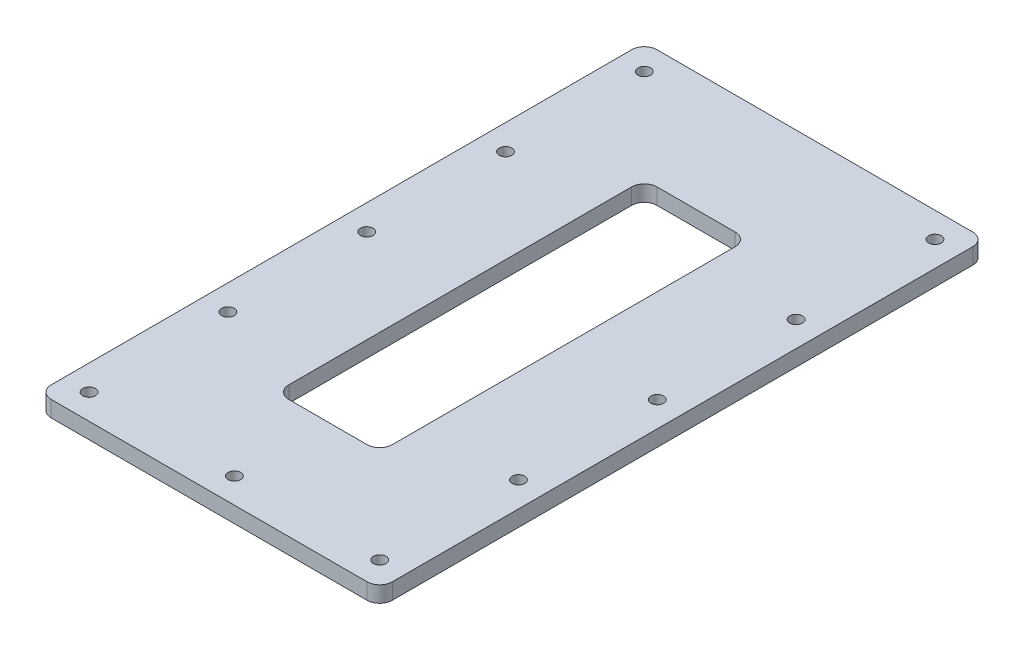
ISO-10303-21;
HEADER;
FILE_DESCRIPTION(('STEP AP214'),'2;1');
FILE_NAME('part.step','',(''),(''),'','','');
FILE_SCHEMA(('AUTOMOTIVE_DESIGN { 1 0 10303 214 1 1 1 1 }'));
ENDSEC;
DATA;
#1=APPLICATION_CONTEXT('core data for automotive mechanical design processes');
#2=APPLICATION_PROTOCOL_DEFINITION('international standard','automotive_design',2000,#1);
#3=PRODUCT_CONTEXT('',#1,'mechanical');
#4=PRODUCT('Part','Part','',(#3));
#5=PRODUCT_RELATED_PRODUCT_CATEGORY('part','',(#4));
#6=PRODUCT_DEFINITION_FORMATION('','',#4);
#7=PRODUCT_DEFINITION_CONTEXT('part definition',#1,'design');
#8=PRODUCT_DEFINITION('design','',#6,#7);
#9=PRODUCT_DEFINITION_SHAPE('','',#8);
#10=(LENGTH_UNIT() NAMED_UNIT(*) SI_UNIT(.MILLI.,.METRE.));
#11=(NAMED_UNIT(*) PLANE_ANGLE_UNIT() SI_UNIT($,.RADIAN.));
#12=(NAMED_UNIT(*) SI_UNIT($,.STERADIAN.) SOLID_ANGLE_UNIT());
#13=UNCERTAINTY_MEASURE_WITH_UNIT(LENGTH_MEASURE(1.E-05),#10,'distance_accuracy_value','');
#14=(GEOMETRIC_REPRESENTATION_CONTEXT(3) GLOBAL_UNCERTAINTY_ASSIGNED_CONTEXT((#13)) GLOBAL_UNIT_ASSIGNED_CONTEXT((#10,
#11,#12)) REPRESENTATION_CONTEXT('',''));
#15=CARTESIAN_POINT('',(0.,0.,0.));
#16=DIRECTION('',(0.,0.,1.));
#17=DIRECTION('',(1.,0.,0.));
#18=AXIS2_PLACEMENT_3D('',#15,#16,#17);
#19=CARTESIAN_POINT('',(67.575,-6.35,-120.));
#20=DIRECTION('',(-1.,0.,0.));
#21=DIRECTION('',(0.,0.,1.));
#22=AXIS2_PLACEMENT_3D('',#19,#20,#21);
#23=PLANE('',#22);
#24=DIRECTION('',(0.,0.,1.));
#25=VECTOR('',#24,1.);
#26=CARTESIAN_POINT('',(67.575,-6.35,-120.));
#27=LINE('',#26,#25);
#28=CARTESIAN_POINT('',(67.575,-6.35,-115.));
#29=VERTEX_POINT('',#28);
#30=CARTESIAN_POINT('',(67.575,-6.35,115.));
#31=VERTEX_POINT('',#30);
#32=EDGE_CURVE('E202',#29,#31,#27,.T.);
#33=ORIENTED_EDGE('',*,*,#32,.F.);
#34=DIRECTION('',(0.,1.,0.));
#35=VECTOR('',#34,1.);
#36=CARTESIAN_POINT('',(67.575,-6.35,-115.));
#37=LINE('',#36,#35);
#38=CARTESIAN_POINT('',(67.575,0.,-115.));
#39=VERTEX_POINT('',#38);
#40=EDGE_CURVE('E256',#29,#39,#37,.T.);
#41=ORIENTED_EDGE('',*,*,#40,.T.);
#42=DIRECTION('',(0.,0.,1.));
#43=VECTOR('',#42,1.);
#44=CARTESIAN_POINT('',(67.575,0.,-120.));
#45=LINE('',#44,#43);
#46=CARTESIAN_POINT('',(67.575,0.,115.));
#47=VERTEX_POINT('',#46);
#48=EDGE_CURVE('E211',#39,#47,#45,.T.);
#49=ORIENTED_EDGE('',*,*,#48,.T.);
#50=DIRECTION('',(0.,1.,0.));
#51=VECTOR('',#50,1.);
#52=CARTESIAN_POINT('',(67.575,-6.35,115.));
#53=LINE('',#52,#51);
#54=EDGE_CURVE('E254',#47,#31,#53,.F.);
#55=ORIENTED_EDGE('',*,*,#54,.T.);
#56=EDGE_LOOP('',(#33,#41,#49,#55));
#57=FACE_BOUND('',#56,.T.);
#58=ADVANCED_FACE('F36',(#57),#23,.F.);
#59=CARTESIAN_POINT('',(-67.575,-6.35,-120.));
#60=DIRECTION('',(1.,0.,0.));
#61=DIRECTION('',(0.,0.,-1.));
#62=AXIS2_PLACEMENT_3D('',#59,#60,#61);
#63=PLANE('',#62);
#64=DIRECTION('',(0.,0.,-1.));
#65=VECTOR('',#64,1.);
#66=CARTESIAN_POINT('',(-67.575,0.,-120.));
#67=LINE('',#66,#65);
#68=CARTESIAN_POINT('',(-67.575,0.,115.));
#69=VERTEX_POINT('',#68);
#70=CARTESIAN_POINT('',(-67.575,0.,-115.));
#71=VERTEX_POINT('',#70);
#72=EDGE_CURVE('E194',#69,#71,#67,.T.);
#73=ORIENTED_EDGE('',*,*,#72,.T.);
#74=DIRECTION('',(0.,1.,0.));
#75=VECTOR('',#74,1.);
#76=CARTESIAN_POINT('',(-67.575,-6.35,-115.));
#77=LINE('',#76,#75);
#78=CARTESIAN_POINT('',(-67.575,-6.35,-115.));
#79=VERTEX_POINT('',#78);
#80=EDGE_CURVE('E245',#71,#79,#77,.F.);
#81=ORIENTED_EDGE('',*,*,#80,.T.);
#82=DIRECTION('',(0.,0.,-1.));
#83=VECTOR('',#82,1.);
#84=CARTESIAN_POINT('',(-67.575,-6.35,-120.));
#85=LINE('',#84,#83);
#86=CARTESIAN_POINT('',(-67.575,-6.35,115.));
#87=VERTEX_POINT('',#86);
#88=EDGE_CURVE('E195',#87,#79,#85,.T.);
#89=ORIENTED_EDGE('',*,*,#88,.F.);
#90=DIRECTION('',(0.,1.,0.));
#91=VECTOR('',#90,1.);
#92=CARTESIAN_POINT('',(-67.575,-6.35,115.));
#93=LINE('',#92,#91);
#94=EDGE_CURVE('E242',#87,#69,#93,.T.);
#95=ORIENTED_EDGE('',*,*,#94,.T.);
#96=EDGE_LOOP('',(#73,#81,#89,#95));
#97=FACE_BOUND('',#96,.T.);
#98=ADVANCED_FACE('F416',(#97),#63,.F.);
#99=CARTESIAN_POINT('',(62.575,-6.35,-115.));
#100=DIRECTION('',(0.,1.,0.));
#101=DIRECTION('',(0.,0.,1.));
#102=AXIS2_PLACEMENT_3D('',#99,#100,#101);
#103=CYLINDRICAL_SURFACE('',#102,5.);
#104=CARTESIAN_POINT('',(62.575,-6.35,-115.));
#105=DIRECTION('',(0.,-1.,0.));
#106=DIRECTION('',(0.,0.,-1.));
#107=AXIS2_PLACEMENT_3D('',#104,#105,#106);
#108=CIRCLE('',#107,5.);
#109=CARTESIAN_POINT('',(62.575,-6.35,-120.));
#110=VERTEX_POINT('',#109);
#111=EDGE_CURVE('E250',#110,#29,#108,.T.);
#112=ORIENTED_EDGE('',*,*,#111,.F.);
#113=DIRECTION('',(0.,1.,0.));
#114=VECTOR('',#113,1.);
#115=CARTESIAN_POINT('',(62.575,-6.35,-120.));
#116=LINE('',#115,#114);
#117=CARTESIAN_POINT('',(62.575,0.,-120.));
#118=VERTEX_POINT('',#117);
#119=EDGE_CURVE('E229',#118,#110,#116,.F.);
#120=ORIENTED_EDGE('',*,*,#119,.F.);
#121=CARTESIAN_POINT('',(62.575,0.,-115.));
#122=DIRECTION('',(0.,-1.,0.));
#123=DIRECTION('',(0.,0.,-1.));
#124=AXIS2_PLACEMENT_3D('',#121,#122,#123);
#125=CIRCLE('',#124,5.);
#126=EDGE_CURVE('E238',#39,#118,#125,.F.);
#127=ORIENTED_EDGE('',*,*,#126,.F.);
#128=ORIENTED_EDGE('',*,*,#40,.F.);
#129=EDGE_LOOP('',(#112,#120,#127,#128));
#130=FACE_BOUND('',#129,.T.);
#131=ADVANCED_FACE('F413',(#130),#103,.T.);
#132=CARTESIAN_POINT('',(-62.575,-6.35,-115.));
#133=DIRECTION('',(0.,1.,0.));
#134=DIRECTION('',(0.,0.,1.));
#135=AXIS2_PLACEMENT_3D('',#132,#133,#134);
#136=CYLINDRICAL_SURFACE('',#135,5.);
#137=CARTESIAN_POINT('',(-62.575,-6.35,-115.));
#138=DIRECTION('',(0.,-1.,0.));
#139=DIRECTION('',(0.,0.,-1.));
#140=AXIS2_PLACEMENT_3D('',#137,#138,#139);
#141=CIRCLE('',#140,5.);
#142=CARTESIAN_POINT('',(-62.575,-6.35,-120.));
#143=VERTEX_POINT('',#142);
#144=EDGE_CURVE('E252',#79,#143,#141,.T.);
#145=ORIENTED_EDGE('',*,*,#144,.F.);
#146=ORIENTED_EDGE('',*,*,#80,.F.);
#147=CARTESIAN_POINT('',(-62.575,0.,-115.));
#148=DIRECTION('',(0.,-1.,0.));
#149=DIRECTION('',(0.,0.,-1.));
#150=AXIS2_PLACEMENT_3D('',#147,#148,#149);
#151=CIRCLE('',#150,5.);
#152=CARTESIAN_POINT('',(-62.575,0.,-120.));
#153=VERTEX_POINT('',#152);
#154=EDGE_CURVE('E240',#153,#71,#151,.F.);
#155=ORIENTED_EDGE('',*,*,#154,.F.);
#156=DIRECTION('',(0.,1.,0.));
#157=VECTOR('',#156,1.);
#158=CARTESIAN_POINT('',(-62.575,-6.35,-120.));
#159=LINE('',#158,#157);
#160=EDGE_CURVE('E231',#143,#153,#159,.T.);
#161=ORIENTED_EDGE('',*,*,#160,.F.);
#162=EDGE_LOOP('',(#145,#146,#155,#161));
#163=FACE_BOUND('',#162,.T.);
#164=ADVANCED_FACE('F410',(#163),#136,.T.);
#165=CARTESIAN_POINT('',(62.575,-6.35,115.));
#166=DIRECTION('',(0.,1.,0.));
#167=DIRECTION('',(0.,0.,1.));
#168=AXIS2_PLACEMENT_3D('',#165,#166,#167);
#169=CYLINDRICAL_SURFACE('',#168,5.);
#170=CARTESIAN_POINT('',(62.575,-6.35,115.));
#171=DIRECTION('',(0.,-1.,0.));
#172=DIRECTION('',(0.,0.,-1.));
#173=AXIS2_PLACEMENT_3D('',#170,#171,#172);
#174=CIRCLE('',#173,5.);
#175=CARTESIAN_POINT('',(62.575,-6.35,120.));
#176=VERTEX_POINT('',#175);
#177=EDGE_CURVE('E60',#31,#176,#174,.T.);
#178=ORIENTED_EDGE('',*,*,#177,.F.);
#179=ORIENTED_EDGE('',*,*,#54,.F.);
#180=CARTESIAN_POINT('',(62.575,0.,115.));
#181=DIRECTION('',(0.,-1.,0.));
#182=DIRECTION('',(0.,0.,-1.));
#183=AXIS2_PLACEMENT_3D('',#180,#181,#182);
#184=CIRCLE('',#183,5.);
#185=CARTESIAN_POINT('',(62.575,0.,120.));
#186=VERTEX_POINT('',#185);
#187=EDGE_CURVE('E234',#186,#47,#184,.F.);
#188=ORIENTED_EDGE('',*,*,#187,.F.);
#189=DIRECTION('',(0.,1.,0.));
#190=VECTOR('',#189,1.);
#191=CARTESIAN_POINT('',(62.575,-6.35,120.));
#192=LINE('',#191,#190);
#193=EDGE_CURVE('E259',#176,#186,#192,.T.);
#194=ORIENTED_EDGE('',*,*,#193,.F.);
#195=EDGE_LOOP('',(#178,#179,#188,#194));
#196=FACE_BOUND('',#195,.T.);
#197=ADVANCED_FACE('F38',(#196),#169,.T.);
#198=CARTESIAN_POINT('',(20.5132278041638,3.65,-72.9382278041638));
#199=DIRECTION('',(1.,0.,0.));
#200=DIRECTION('',(0.,1.,0.));
#201=AXIS2_PLACEMENT_3D('',#198,#199,#200);
#202=PLANE('',#201);
#203=DIRECTION('',(0.,0.,1.));
#204=VECTOR('',#203,1.);
#205=CARTESIAN_POINT('',(20.5132278041638,-6.35,-72.9382278041638));
#206=LINE('',#205,#204);
#207=CARTESIAN_POINT('',(20.5132278041638,-6.35,-67.9382278041638));
#208=VERTEX_POINT('',#207);
#209=CARTESIAN_POINT('',(20.5132278041638,-6.35,67.9382278041638));
#210=VERTEX_POINT('',#209);
#211=EDGE_CURVE('E179',#208,#210,#206,.T.);
#212=ORIENTED_EDGE('',*,*,#211,.T.);
#213=DIRECTION('',(0.,-1.,0.));
#214=VECTOR('',#213,1.);
#215=CARTESIAN_POINT('',(20.5132278041638,0.,67.9382278041638));
#216=LINE('',#215,#214);
#217=CARTESIAN_POINT('',(20.5132278041638,0.,67.9382278041638));
#218=VERTEX_POINT('',#217);
#219=EDGE_CURVE('E157',#210,#218,#216,.F.);
#220=ORIENTED_EDGE('',*,*,#219,.T.);
#221=DIRECTION('',(0.,0.,1.));
#222=VECTOR('',#221,1.);
#223=CARTESIAN_POINT('',(20.5132278041638,0.,0.));
#224=LINE('',#223,#222);
#225=CARTESIAN_POINT('',(20.5132278041638,0.,-67.9382278041638));
#226=VERTEX_POINT('',#225);
#227=EDGE_CURVE('E182',#226,#218,#224,.T.);
#228=ORIENTED_EDGE('',*,*,#227,.F.);
#229=DIRECTION('',(0.,-1.,0.));
#230=VECTOR('',#229,1.);
#231=CARTESIAN_POINT('',(20.5132278041638,-6.35,-67.9382278041638));
#232=LINE('',#231,#230);
#233=EDGE_CURVE('E172',#226,#208,#232,.T.);
#234=ORIENTED_EDGE('',*,*,#233,.T.);
#235=EDGE_LOOP('',(#212,#220,#228,#234));
#236=FACE_BOUND('',#235,.T.);
#237=ADVANCED_FACE('F376',(#236),#202,.F.);
#238=CARTESIAN_POINT('',(0.,-6.35,0.));
#239=DIRECTION('',(0.,-1.,0.));
#240=DIRECTION('',(0.,0.,-1.));
#241=AXIS2_PLACEMENT_3D('',#238,#239,#240);
#242=PLANE('',#241);
#243=CARTESIAN_POINT('',(57.5749999999999,-6.35,-110.));
#244=DIRECTION('',(0.,-1.,0.));
#245=DIRECTION('',(0.,0.,-1.));
#246=AXIS2_PLACEMENT_3D('',#243,#244,#245);
#247=CIRCLE('',#246,2.5);
#248=CARTESIAN_POINT('',(57.5749999999999,-6.35,-112.5));
#249=VERTEX_POINT('',#248);
#250=EDGE_CURVE('E40',#249,#249,#247,.T.);
#251=ORIENTED_EDGE('',*,*,#250,.F.);
#252=EDGE_LOOP('',(#251));
#253=FACE_BOUND('',#252,.T.);
#254=CARTESIAN_POINT('',(-57.5750000000001,-6.35,-110.));
#255=DIRECTION('',(0.,-1.,0.));
#256=DIRECTION('',(0.,0.,-1.));
#257=AXIS2_PLACEMENT_3D('',#254,#255,#256);
#258=CIRCLE('',#257,2.50000000000001);
#259=CARTESIAN_POINT('',(-57.5750000000001,-6.35,-112.5));
#260=VERTEX_POINT('',#259);
#261=EDGE_CURVE('E299',#260,#260,#258,.T.);
#262=ORIENTED_EDGE('',*,*,#261,.F.);
#263=EDGE_LOOP('',(#262));
#264=FACE_BOUND('',#263,.T.);
#265=CARTESIAN_POINT('',(-57.5750000000001,-6.35,-55.));
#266=DIRECTION('',(0.,-1.,0.));
#267=DIRECTION('',(0.,0.,-1.));
#268=AXIS2_PLACEMENT_3D('',#265,#266,#267);
#269=CIRCLE('',#268,2.5);
#270=CARTESIAN_POINT('',(-57.5750000000001,-6.35,-57.5));
#271=VERTEX_POINT('',#270);
#272=EDGE_CURVE('E297',#271,#271,#269,.T.);
#273=ORIENTED_EDGE('',*,*,#272,.F.);
#274=EDGE_LOOP('',(#273));
#275=FACE_BOUND('',#274,.T.);
#276=CARTESIAN_POINT('',(57.5749999999999,-6.35,-55.));
#277=DIRECTION('',(0.,-1.,0.));
#278=DIRECTION('',(0.,0.,-1.));
#279=AXIS2_PLACEMENT_3D('',#276,#277,#278);
#280=CIRCLE('',#279,2.5);
#281=CARTESIAN_POINT('',(57.5749999999999,-6.35,-57.5));
#282=VERTEX_POINT('',#281);
#283=EDGE_CURVE('E294',#282,#282,#280,.T.);
#284=ORIENTED_EDGE('',*,*,#283,.F.);
#285=EDGE_LOOP('',(#284));
#286=FACE_BOUND('',#285,.T.);
#287=CARTESIAN_POINT('',(57.5749999999999,-6.35,0.));
#288=DIRECTION('',(0.,-1.,0.));
#289=DIRECTION('',(0.,0.,-1.));
#290=AXIS2_PLACEMENT_3D('',#287,#288,#289);
#291=CIRCLE('',#290,2.5);
#292=CARTESIAN_POINT('',(57.5749999999999,-6.35,-2.49999999999996));
#293=VERTEX_POINT('',#292);
#294=EDGE_CURVE('E291',#293,#293,#291,.T.);
#295=ORIENTED_EDGE('',*,*,#294,.F.);
#296=EDGE_LOOP('',(#295));
#297=FACE_BOUND('',#296,.T.);
#298=CARTESIAN_POINT('',(-57.5750000000001,-6.35,0.));
#299=DIRECTION('',(0.,-1.,0.));
#300=DIRECTION('',(0.,0.,-1.));
#301=AXIS2_PLACEMENT_3D('',#298,#299,#300);
#302=CIRCLE('',#301,2.5);
#303=CARTESIAN_POINT('',(-57.5750000000001,-6.35,-2.49999999999996));
#304=VERTEX_POINT('',#303);
#305=EDGE_CURVE('E288',#304,#304,#302,.T.);
#306=ORIENTED_EDGE('',*,*,#305,.F.);
#307=EDGE_LOOP('',(#306));
#308=FACE_BOUND('',#307,.T.);
#309=CARTESIAN_POINT('',(-57.5750000000001,-6.35,55.));
#310=DIRECTION('',(0.,-1.,0.));
#311=DIRECTION('',(0.,0.,-1.));
#312=AXIS2_PLACEMENT_3D('',#309,#310,#311);
#313=CIRCLE('',#312,2.5);
#314=CARTESIAN_POINT('',(-57.5750000000001,-6.35,52.5));
#315=VERTEX_POINT('',#314);
#316=EDGE_CURVE('E285',#315,#315,#313,.T.);
#317=ORIENTED_EDGE('',*,*,#316,.F.);
#318=EDGE_LOOP('',(#317));
#319=FACE_BOUND('',#318,.T.);
#320=CARTESIAN_POINT('',(57.5749999999999,-6.35,55.));
#321=DIRECTION('',(0.,-1.,0.));
#322=DIRECTION('',(0.,0.,-1.));
#323=AXIS2_PLACEMENT_3D('',#320,#321,#322);
#324=CIRCLE('',#323,2.5);
#325=CARTESIAN_POINT('',(57.5749999999999,-6.35,52.5));
#326=VERTEX_POINT('',#325);
#327=EDGE_CURVE('E282',#326,#326,#324,.T.);
#328=ORIENTED_EDGE('',*,*,#327,.F.);
#329=EDGE_LOOP('',(#328));
#330=FACE_BOUND('',#329,.T.);
#331=CARTESIAN_POINT('',(57.5749999999999,-6.35,110.));
#332=DIRECTION('',(0.,-1.,0.));
#333=DIRECTION('',(0.,0.,-1.));
#334=AXIS2_PLACEMENT_3D('',#331,#332,#333);
#335=CIRCLE('',#334,2.50000000000001);
#336=CARTESIAN_POINT('',(57.5749999999999,-6.35,107.5));
#337=VERTEX_POINT('',#336);
#338=EDGE_CURVE('E279',#337,#337,#335,.T.);
#339=ORIENTED_EDGE('',*,*,#338,.F.);
#340=EDGE_LOOP('',(#339));
#341=FACE_BOUND('',#340,.T.);
#342=CARTESIAN_POINT('',(-1.11022302462516E-13,-6.35,110.));
#343=DIRECTION('',(0.,-1.,0.));
#344=DIRECTION('',(0.,0.,-1.));
#345=AXIS2_PLACEMENT_3D('',#342,#343,#344);
#346=CIRCLE('',#345,2.5);
#347=CARTESIAN_POINT('',(-1.11022302462516E-13,-6.35,107.5));
#348=VERTEX_POINT('',#347);
#349=EDGE_CURVE('E275',#348,#348,#346,.T.);
#350=ORIENTED_EDGE('',*,*,#349,.F.);
#351=EDGE_LOOP('',(#350));
#352=FACE_BOUND('',#351,.T.);
#353=CARTESIAN_POINT('',(-57.5750000000001,-6.35,110.));
#354=DIRECTION('',(0.,-1.,0.));
#355=DIRECTION('',(0.,0.,-1.));
#356=AXIS2_PLACEMENT_3D('',#353,#354,#355);
#357=CIRCLE('',#356,2.5);
#358=CARTESIAN_POINT('',(-57.5750000000001,-6.35,107.5));
#359=VERTEX_POINT('',#358);
#360=EDGE_CURVE('E272',#359,#359,#357,.T.);
#361=ORIENTED_EDGE('',*,*,#360,.F.);
#362=EDGE_LOOP('',(#361));
#363=FACE_BOUND('',#362,.T.);
#364=DIRECTION('',(0.,0.,-1.));
#365=VECTOR('',#364,1.);
#366=CARTESIAN_POINT('',(-20.5132278041638,-6.35,-72.9382278041638));
#367=LINE('',#366,#365);
#368=CARTESIAN_POINT('',(-20.5132278041638,-6.35,67.9382278041638));
#369=VERTEX_POINT('',#368);
#370=CARTESIAN_POINT('',(-20.5132278041638,-6.35,-67.9382278041638));
#371=VERTEX_POINT('',#370);
#372=EDGE_CURVE('E304',#369,#371,#367,.T.);
#373=ORIENTED_EDGE('',*,*,#372,.F.);
#374=CARTESIAN_POINT('',(-15.5132278041638,-6.35,67.9382278041638));
#375=DIRECTION('',(0.,-1.,0.));
#376=DIRECTION('',(0.,0.,-1.));
#377=AXIS2_PLACEMENT_3D('',#374,#375,#376);
#378=CIRCLE('',#377,5.);
#379=CARTESIAN_POINT('',(-15.5132278041638,-6.35,72.9382278041638));
#380=VERTEX_POINT('',#379);
#381=EDGE_CURVE('E177',#369,#380,#378,.F.);
#382=ORIENTED_EDGE('',*,*,#381,.T.);
#383=DIRECTION('',(-1.,0.,0.));
#384=VECTOR('',#383,1.);
#385=CARTESIAN_POINT('',(20.5132278041638,-6.35,72.9382278041638));
#386=LINE('',#385,#384);
#387=CARTESIAN_POINT('',(15.5132278041638,-6.35,72.9382278041638));
#388=VERTEX_POINT('',#387);
#389=EDGE_CURVE('E168',#388,#380,#386,.T.);
#390=ORIENTED_EDGE('',*,*,#389,.F.);
#391=CARTESIAN_POINT('',(15.5132278041638,-6.35,67.9382278041638));
#392=DIRECTION('',(0.,-1.,0.));
#393=DIRECTION('',(0.,0.,-1.));
#394=AXIS2_PLACEMENT_3D('',#391,#392,#393);
#395=CIRCLE('',#394,5.);
#396=EDGE_CURVE('E152',#388,#210,#395,.F.);
#397=ORIENTED_EDGE('',*,*,#396,.T.);
#398=ORIENTED_EDGE('',*,*,#211,.F.);
#399=CARTESIAN_POINT('',(15.5132278041638,-6.35,-67.9382278041638));
#400=DIRECTION('',(0.,-1.,0.));
#401=DIRECTION('',(0.,0.,-1.));
#402=AXIS2_PLACEMENT_3D('',#399,#400,#401);
#403=CIRCLE('',#402,5.);
#404=CARTESIAN_POINT('',(15.5132278041638,-6.35,-72.9382278041638));
#405=VERTEX_POINT('',#404);
#406=EDGE_CURVE('E45',#208,#405,#403,.F.);
#407=ORIENTED_EDGE('',*,*,#406,.T.);
#408=DIRECTION('',(1.,0.,0.));
#409=VECTOR('',#408,1.);
#410=CARTESIAN_POINT('',(20.5132278041638,-6.35,-72.9382278041638));
#411=LINE('',#410,#409);
#412=CARTESIAN_POINT('',(-15.5132278041638,-6.35,-72.9382278041638));
#413=VERTEX_POINT('',#412);
#414=EDGE_CURVE('E184',#413,#405,#411,.T.);
#415=ORIENTED_EDGE('',*,*,#414,.F.);
#416=CARTESIAN_POINT('',(-15.5132278041638,-6.35,-67.9382278041638));
#417=DIRECTION('',(0.,-1.,0.));
#418=DIRECTION('',(0.,0.,-1.));
#419=AXIS2_PLACEMENT_3D('',#416,#417,#418);
#420=CIRCLE('',#419,5.);
#421=EDGE_CURVE('E267',#413,#371,#420,.F.);
#422=ORIENTED_EDGE('',*,*,#421,.T.);
#423=EDGE_LOOP('',(#373,#382,#390,#397,#398,#407,#415,#422));
#424=FACE_BOUND('',#423,.T.);
#425=ORIENTED_EDGE('',*,*,#88,.T.);
#426=ORIENTED_EDGE('',*,*,#144,.T.);
#427=DIRECTION('',(1.,0.,0.));
#428=VECTOR('',#427,1.);
#429=CARTESIAN_POINT('',(67.575,-6.35,-120.));
#430=LINE('',#429,#428);
#431=EDGE_CURVE('E198',#143,#110,#430,.T.);
#432=ORIENTED_EDGE('',*,*,#431,.T.);
#433=ORIENTED_EDGE('',*,*,#111,.T.);
#434=ORIENTED_EDGE('',*,*,#32,.T.);
#435=ORIENTED_EDGE('',*,*,#177,.T.);
#436=DIRECTION('',(-1.,0.,0.));
#437=VECTOR('',#436,1.);
#438=CARTESIAN_POINT('',(67.575,-6.35,120.));
#439=LINE('',#438,#437);
#440=CARTESIAN_POINT('',(-62.575,-6.35,120.));
#441=VERTEX_POINT('',#440);
#442=EDGE_CURVE('E204',#176,#441,#439,.T.);
#443=ORIENTED_EDGE('',*,*,#442,.T.);
#444=CARTESIAN_POINT('',(-62.575,-6.35,115.));
#445=DIRECTION('',(0.,-1.,0.));
#446=DIRECTION('',(0.,0.,-1.));
#447=AXIS2_PLACEMENT_3D('',#444,#445,#446);
#448=CIRCLE('',#447,5.);
#449=EDGE_CURVE('E248',#441,#87,#448,.T.);
#450=ORIENTED_EDGE('',*,*,#449,.T.);
#451=EDGE_LOOP('',(#425,#426,#432,#433,#434,#435,#443,#450));
#452=FACE_BOUND('',#451,.T.);
#453=ADVANCED_FACE('F176',(#253,#264,#275,#286,#297,#308,#319,#330,#341,#352,#363,#424,#452),
#242,.T.);
#454=CARTESIAN_POINT('',(57.5749999999999,-10.,-110.));
#455=DIRECTION('',(0.,1.,0.));
#456=DIRECTION('',(0.,0.,1.));
#457=AXIS2_PLACEMENT_3D('',#454,#455,#456);
#458=CYLINDRICAL_SURFACE('',#457,2.5);
#459=ORIENTED_EDGE('',*,*,#250,.T.);
#460=EDGE_LOOP('',(#459));
#461=FACE_BOUND('',#460,.T.);
#462=CARTESIAN_POINT('',(57.5749999999999,0.,-110.));
#463=DIRECTION('',(0.,1.,0.));
#464=DIRECTION('',(0.,0.,1.));
#465=AXIS2_PLACEMENT_3D('',#462,#463,#464);
#466=CIRCLE('',#465,2.5);
#467=CARTESIAN_POINT('',(57.5749999999999,0.,-107.5));
#468=VERTEX_POINT('',#467);
#469=EDGE_CURVE('E316',#468,#468,#466,.T.);
#470=ORIENTED_EDGE('',*,*,#469,.T.);
#471=EDGE_LOOP('',(#470));
#472=FACE_BOUND('',#471,.T.);
#473=ADVANCED_FACE('F464',(#461,#472),#458,.F.);
#474=CARTESIAN_POINT('',(-57.5750000000001,-10.,-110.));
#475=DIRECTION('',(0.,1.,0.));
#476=DIRECTION('',(0.,0.,1.));
#477=AXIS2_PLACEMENT_3D('',#474,#475,#476);
#478=CYLINDRICAL_SURFACE('',#477,2.50000000000001);
#479=ORIENTED_EDGE('',*,*,#261,.T.);
#480=EDGE_LOOP('',(#479));
#481=FACE_BOUND('',#480,.T.);
#482=CARTESIAN_POINT('',(-57.5750000000001,0.,-110.));
#483=DIRECTION('',(0.,1.,0.));
#484=DIRECTION('',(0.,0.,1.));
#485=AXIS2_PLACEMENT_3D('',#482,#483,#484);
#486=CIRCLE('',#485,2.50000000000001);
#487=CARTESIAN_POINT('',(-57.5750000000001,0.,-107.5));
#488=VERTEX_POINT('',#487);
#489=EDGE_CURVE('E319',#488,#488,#486,.T.);
#490=ORIENTED_EDGE('',*,*,#489,.T.);
#491=EDGE_LOOP('',(#490));
#492=FACE_BOUND('',#491,.T.);
#493=ADVANCED_FACE('F521',(#481,#492),#478,.F.);
#494=CARTESIAN_POINT('',(-57.5750000000001,-10.,-55.));
#495=DIRECTION('',(0.,1.,0.));
#496=DIRECTION('',(0.,0.,1.));
#497=AXIS2_PLACEMENT_3D('',#494,#495,#496);
#498=CYLINDRICAL_SURFACE('',#497,2.5);
#499=ORIENTED_EDGE('',*,*,#272,.T.);
#500=EDGE_LOOP('',(#499));
#501=FACE_BOUND('',#500,.T.);
#502=CARTESIAN_POINT('',(-57.5750000000001,0.,-55.));
#503=DIRECTION('',(0.,1.,0.));
#504=DIRECTION('',(0.,0.,1.));
#505=AXIS2_PLACEMENT_3D('',#502,#503,#504);
#506=CIRCLE('',#505,2.5);
#507=CARTESIAN_POINT('',(-57.5750000000001,0.,-52.5));
#508=VERTEX_POINT('',#507);
#509=EDGE_CURVE('E322',#508,#508,#506,.T.);
#510=ORIENTED_EDGE('',*,*,#509,.T.);
#511=EDGE_LOOP('',(#510));
#512=FACE_BOUND('',#511,.T.);
#513=ADVANCED_FACE('F528',(#501,#512),#498,.F.);
#514=CARTESIAN_POINT('',(57.5749999999999,-10.,-55.));
#515=DIRECTION('',(0.,1.,0.));
#516=DIRECTION('',(0.,0.,1.));
#517=AXIS2_PLACEMENT_3D('',#514,#515,#516);
#518=CYLINDRICAL_SURFACE('',#517,2.5);
#519=ORIENTED_EDGE('',*,*,#283,.T.);
#520=EDGE_LOOP('',(#519));
#521=FACE_BOUND('',#520,.T.);
#522=CARTESIAN_POINT('',(57.5749999999999,0.,-55.));
#523=DIRECTION('',(0.,1.,0.));
#524=DIRECTION('',(0.,0.,1.));
#525=AXIS2_PLACEMENT_3D('',#522,#523,#524);
#526=CIRCLE('',#525,2.5);
#527=CARTESIAN_POINT('',(57.5749999999999,0.,-52.5));
#528=VERTEX_POINT('',#527);
#529=EDGE_CURVE('E325',#528,#528,#526,.T.);
#530=ORIENTED_EDGE('',*,*,#529,.T.);
#531=EDGE_LOOP('',(#530));
#532=FACE_BOUND('',#531,.T.);
#533=ADVANCED_FACE('F535',(#521,#532),#518,.F.);
#534=CARTESIAN_POINT('',(57.5749999999999,-10.,0.));
#535=DIRECTION('',(0.,1.,0.));
#536=DIRECTION('',(0.,0.,1.));
#537=AXIS2_PLACEMENT_3D('',#534,#535,#536);
#538=CYLINDRICAL_SURFACE('',#537,2.5);
#539=ORIENTED_EDGE('',*,*,#294,.T.);
#540=EDGE_LOOP('',(#539));
#541=FACE_BOUND('',#540,.T.);
#542=CARTESIAN_POINT('',(57.5749999999999,0.,0.));
#543=DIRECTION('',(0.,1.,0.));
#544=DIRECTION('',(0.,0.,1.));
#545=AXIS2_PLACEMENT_3D('',#542,#543,#544);
#546=CIRCLE('',#545,2.5);
#547=CARTESIAN_POINT('',(57.5749999999999,0.,2.50000000000004));
#548=VERTEX_POINT('',#547);
#549=EDGE_CURVE('E328',#548,#548,#546,.T.);
#550=ORIENTED_EDGE('',*,*,#549,.T.);
#551=EDGE_LOOP('',(#550));
#552=FACE_BOUND('',#551,.T.);
#553=ADVANCED_FACE('F544',(#541,#552),#538,.F.);
#554=CARTESIAN_POINT('',(-57.5750000000001,-10.,0.));
#555=DIRECTION('',(0.,1.,0.));
#556=DIRECTION('',(0.,0.,1.));
#557=AXIS2_PLACEMENT_3D('',#554,#555,#556);
#558=CYLINDRICAL_SURFACE('',#557,2.5);
#559=ORIENTED_EDGE('',*,*,#305,.T.);
#560=EDGE_LOOP('',(#559));
#561=FACE_BOUND('',#560,.T.);
#562=CARTESIAN_POINT('',(-57.5750000000001,0.,0.));
#563=DIRECTION('',(0.,1.,0.));
#564=DIRECTION('',(0.,0.,1.));
#565=AXIS2_PLACEMENT_3D('',#562,#563,#564);
#566=CIRCLE('',#565,2.5);
#567=CARTESIAN_POINT('',(-57.5750000000001,0.,2.50000000000005));
#568=VERTEX_POINT('',#567);
#569=EDGE_CURVE('E331',#568,#568,#566,.T.);
#570=ORIENTED_EDGE('',*,*,#569,.T.);
#571=EDGE_LOOP('',(#570));
#572=FACE_BOUND('',#571,.T.);
#573=ADVANCED_FACE('F553',(#561,#572),#558,.F.);
#574=CARTESIAN_POINT('',(-57.5750000000001,-10.,55.));
#575=DIRECTION('',(0.,1.,0.));
#576=DIRECTION('',(0.,0.,1.));
#577=AXIS2_PLACEMENT_3D('',#574,#575,#576);
#578=CYLINDRICAL_SURFACE('',#577,2.5);
#579=ORIENTED_EDGE('',*,*,#316,.T.);
#580=EDGE_LOOP('',(#579));
#581=FACE_BOUND('',#580,.T.);
#582=CARTESIAN_POINT('',(-57.5750000000001,0.,55.));
#583=DIRECTION('',(0.,1.,0.));
#584=DIRECTION('',(0.,0.,1.));
#585=AXIS2_PLACEMENT_3D('',#582,#583,#584);
#586=CIRCLE('',#585,2.5);
#587=CARTESIAN_POINT('',(-57.5750000000001,0.,57.5));
#588=VERTEX_POINT('',#587);
#589=EDGE_CURVE('E334',#588,#588,#586,.T.);
#590=ORIENTED_EDGE('',*,*,#589,.T.);
#591=EDGE_LOOP('',(#590));
#592=FACE_BOUND('',#591,.T.);
#593=ADVANCED_FACE('F562',(#581,#592),#578,.F.);
#594=CARTESIAN_POINT('',(57.5749999999999,-10.,55.));
#595=DIRECTION('',(0.,1.,0.));
#596=DIRECTION('',(0.,0.,1.));
#597=AXIS2_PLACEMENT_3D('',#594,#595,#596);
#598=CYLINDRICAL_SURFACE('',#597,2.5);
#599=ORIENTED_EDGE('',*,*,#327,.T.);
#600=EDGE_LOOP('',(#599));
#601=FACE_BOUND('',#600,.T.);
#602=CARTESIAN_POINT('',(57.5749999999999,0.,55.));
#603=DIRECTION('',(0.,1.,0.));
#604=DIRECTION('',(0.,0.,1.));
#605=AXIS2_PLACEMENT_3D('',#602,#603,#604);
#606=CIRCLE('',#605,2.5);
#607=CARTESIAN_POINT('',(57.5749999999999,0.,57.5));
#608=VERTEX_POINT('',#607);
#609=EDGE_CURVE('E337',#608,#608,#606,.T.);
#610=ORIENTED_EDGE('',*,*,#609,.T.);
#611=EDGE_LOOP('',(#610));
#612=FACE_BOUND('',#611,.T.);
#613=ADVANCED_FACE('F571',(#601,#612),#598,.F.);
#614=CARTESIAN_POINT('',(57.5749999999999,-10.,110.));
#615=DIRECTION('',(0.,1.,0.));
#616=DIRECTION('',(0.,0.,1.));
#617=AXIS2_PLACEMENT_3D('',#614,#615,#616);
#618=CYLINDRICAL_SURFACE('',#617,2.50000000000001);
#619=ORIENTED_EDGE('',*,*,#338,.T.);
#620=EDGE_LOOP('',(#619));
#621=FACE_BOUND('',#620,.T.);
#622=CARTESIAN_POINT('',(57.5749999999999,0.,110.));
#623=DIRECTION('',(0.,1.,0.));
#624=DIRECTION('',(0.,0.,1.));
#625=AXIS2_PLACEMENT_3D('',#622,#623,#624);
#626=CIRCLE('',#625,2.50000000000001);
#627=CARTESIAN_POINT('',(57.5749999999999,0.,112.5));
#628=VERTEX_POINT('',#627);
#629=EDGE_CURVE('E340',#628,#628,#626,.T.);
#630=ORIENTED_EDGE('',*,*,#629,.T.);
#631=EDGE_LOOP('',(#630));
#632=FACE_BOUND('',#631,.T.);
#633=ADVANCED_FACE('F460',(#621,#632),#618,.F.);
#634=CARTESIAN_POINT('',(-1.11022302462516E-13,-10.,110.));
#635=DIRECTION('',(0.,1.,0.));
#636=DIRECTION('',(0.,0.,1.));
#637=AXIS2_PLACEMENT_3D('',#634,#635,#636);
#638=CYLINDRICAL_SURFACE('',#637,2.5);
#639=ORIENTED_EDGE('',*,*,#349,.T.);
#640=EDGE_LOOP('',(#639));
#641=FACE_BOUND('',#640,.T.);
#642=CARTESIAN_POINT('',(-1.11022302462516E-13,0.,110.));
#643=DIRECTION('',(0.,1.,0.));
#644=DIRECTION('',(0.,0.,1.));
#645=AXIS2_PLACEMENT_3D('',#642,#643,#644);
#646=CIRCLE('',#645,2.5);
#647=CARTESIAN_POINT('',(-1.11022302462516E-13,0.,112.5));
#648=VERTEX_POINT('',#647);
#649=EDGE_CURVE('E315',#648,#648,#646,.T.);
#650=ORIENTED_EDGE('',*,*,#649,.T.);
#651=EDGE_LOOP('',(#650));
#652=FACE_BOUND('',#651,.T.);
#653=ADVANCED_FACE('F346',(#641,#652),#638,.F.);
#654=CARTESIAN_POINT('',(-57.5750000000001,-10.,110.));
#655=DIRECTION('',(0.,1.,0.));
#656=DIRECTION('',(0.,0.,1.));
#657=AXIS2_PLACEMENT_3D('',#654,#655,#656);
#658=CYLINDRICAL_SURFACE('',#657,2.5);
#659=ORIENTED_EDGE('',*,*,#360,.T.);
#660=EDGE_LOOP('',(#659));
#661=FACE_BOUND('',#660,.T.);
#662=CARTESIAN_POINT('',(-57.5750000000001,0.,110.));
#663=DIRECTION('',(0.,1.,0.));
#664=DIRECTION('',(0.,0.,1.));
#665=AXIS2_PLACEMENT_3D('',#662,#663,#664);
#666=CIRCLE('',#665,2.5);
#667=CARTESIAN_POINT('',(-57.5750000000001,0.,112.5));
#668=VERTEX_POINT('',#667);
#669=EDGE_CURVE('E276',#668,#668,#666,.T.);
#670=ORIENTED_EDGE('',*,*,#669,.T.);
#671=EDGE_LOOP('',(#670));
#672=FACE_BOUND('',#671,.T.);
#673=ADVANCED_FACE('F450',(#661,#672),#658,.F.);
#674=CARTESIAN_POINT('',(20.5132278041638,3.65,-72.9382278041638));
#675=DIRECTION('',(0.,0.,-1.));
#676=DIRECTION('',(0.,1.,0.));
#677=AXIS2_PLACEMENT_3D('',#674,#675,#676);
#678=PLANE('',#677);
#679=DIRECTION('',(1.,0.,0.));
#680=VECTOR('',#679,1.);
#681=CARTESIAN_POINT('',(0.,0.,-72.9382278041638));
#682=LINE('',#681,#680);
#683=CARTESIAN_POINT('',(-15.5132278041638,0.,-72.9382278041638));
#684=VERTEX_POINT('',#683);
#685=CARTESIAN_POINT('',(15.5132278041638,0.,-72.9382278041638));
#686=VERTEX_POINT('',#685);
#687=EDGE_CURVE('E178',#684,#686,#682,.T.);
#688=ORIENTED_EDGE('',*,*,#687,.F.);
#689=DIRECTION('',(0.,-1.,0.));
#690=VECTOR('',#689,1.);
#691=CARTESIAN_POINT('',(-15.5132278041638,-6.35,-72.9382278041638));
#692=LINE('',#691,#690);
#693=EDGE_CURVE('E226',#684,#413,#692,.T.);
#694=ORIENTED_EDGE('',*,*,#693,.T.);
#695=ORIENTED_EDGE('',*,*,#414,.T.);
#696=DIRECTION('',(0.,-1.,0.));
#697=VECTOR('',#696,1.);
#698=CARTESIAN_POINT('',(15.5132278041638,0.,-72.9382278041638));
#699=LINE('',#698,#697);
#700=EDGE_CURVE('E224',#405,#686,#699,.F.);
#701=ORIENTED_EDGE('',*,*,#700,.T.);
#702=EDGE_LOOP('',(#688,#694,#695,#701));
#703=FACE_BOUND('',#702,.T.);
#704=ADVANCED_FACE('F383',(#703),#678,.F.);
#705=CARTESIAN_POINT('',(15.5132278041638,3.65,-67.9382278041638));
#706=DIRECTION('',(0.,1.,0.));
#707=DIRECTION('',(0.,0.,1.));
#708=AXIS2_PLACEMENT_3D('',#705,#706,#707);
#709=CYLINDRICAL_SURFACE('',#708,5.);
#710=CARTESIAN_POINT('',(15.5132278041638,0.,-67.9382278041638));
#711=DIRECTION('',(0.,-1.,0.));
#712=DIRECTION('',(0.,0.,-1.));
#713=AXIS2_PLACEMENT_3D('',#710,#711,#712);
#714=CIRCLE('',#713,5.);
#715=EDGE_CURVE('E11',#686,#226,#714,.T.);
#716=ORIENTED_EDGE('',*,*,#715,.F.);
#717=ORIENTED_EDGE('',*,*,#700,.F.);
#718=ORIENTED_EDGE('',*,*,#406,.F.);
#719=ORIENTED_EDGE('',*,*,#233,.F.);
#720=EDGE_LOOP('',(#716,#717,#718,#719));
#721=FACE_BOUND('',#720,.T.);
#722=ADVANCED_FACE('F378',(#721),#709,.F.);
#723=CARTESIAN_POINT('',(-20.5132278041638,3.65,-72.9382278041638));
#724=DIRECTION('',(-1.,0.,0.));
#725=DIRECTION('',(0.,-1.,0.));
#726=AXIS2_PLACEMENT_3D('',#723,#724,#725);
#727=PLANE('',#726);
#728=DIRECTION('',(0.,0.,-1.));
#729=VECTOR('',#728,1.);
#730=CARTESIAN_POINT('',(-20.5132278041638,0.,0.));
#731=LINE('',#730,#729);
#732=CARTESIAN_POINT('',(-20.5132278041638,0.,67.9382278041638));
#733=VERTEX_POINT('',#732);
#734=CARTESIAN_POINT('',(-20.5132278041638,0.,-67.9382278041638));
#735=VERTEX_POINT('',#734);
#736=EDGE_CURVE('E191',#733,#735,#731,.T.);
#737=ORIENTED_EDGE('',*,*,#736,.F.);
#738=DIRECTION('',(0.,-1.,0.));
#739=VECTOR('',#738,1.);
#740=CARTESIAN_POINT('',(-20.5132278041638,-6.35,67.9382278041638));
#741=LINE('',#740,#739);
#742=EDGE_CURVE('E221',#733,#369,#741,.T.);
#743=ORIENTED_EDGE('',*,*,#742,.T.);
#744=ORIENTED_EDGE('',*,*,#372,.T.);
#745=DIRECTION('',(0.,-1.,0.));
#746=VECTOR('',#745,1.);
#747=CARTESIAN_POINT('',(-20.5132278041638,0.,-67.9382278041638));
#748=LINE('',#747,#746);
#749=EDGE_CURVE('E219',#371,#735,#748,.F.);
#750=ORIENTED_EDGE('',*,*,#749,.T.);
#751=EDGE_LOOP('',(#737,#743,#744,#750));
#752=FACE_BOUND('',#751,.T.);
#753=ADVANCED_FACE('F389',(#752),#727,.F.);
#754=CARTESIAN_POINT('',(-15.5132278041638,3.65,-67.9382278041638));
#755=DIRECTION('',(0.,1.,0.));
#756=DIRECTION('',(0.,0.,1.));
#757=AXIS2_PLACEMENT_3D('',#754,#755,#756);
#758=CYLINDRICAL_SURFACE('',#757,5.);
#759=CARTESIAN_POINT('',(-15.5132278041638,0.,-67.9382278041638));
#760=DIRECTION('',(0.,-1.,0.));
#761=DIRECTION('',(0.,0.,-1.));
#762=AXIS2_PLACEMENT_3D('',#759,#760,#761);
#763=CIRCLE('',#762,5.);
#764=EDGE_CURVE('E269',#735,#684,#763,.T.);
#765=ORIENTED_EDGE('',*,*,#764,.F.);
#766=ORIENTED_EDGE('',*,*,#749,.F.);
#767=ORIENTED_EDGE('',*,*,#421,.F.);
#768=ORIENTED_EDGE('',*,*,#693,.F.);
#769=EDGE_LOOP('',(#765,#766,#767,#768));
#770=FACE_BOUND('',#769,.T.);
#771=ADVANCED_FACE('F387',(#770),#758,.F.);
#772=CARTESIAN_POINT('',(20.5132278041638,3.65,72.9382278041638));
#773=DIRECTION('',(0.,0.,1.));
#774=DIRECTION('',(0.,-1.,0.));
#775=AXIS2_PLACEMENT_3D('',#772,#773,#774);
#776=PLANE('',#775);
#777=DIRECTION('',(-1.,0.,0.));
#778=VECTOR('',#777,1.);
#779=CARTESIAN_POINT('',(0.,0.,72.9382278041638));
#780=LINE('',#779,#778);
#781=CARTESIAN_POINT('',(15.5132278041638,0.,72.9382278041638));
#782=VERTEX_POINT('',#781);
#783=CARTESIAN_POINT('',(-15.5132278041638,0.,72.9382278041638));
#784=VERTEX_POINT('',#783);
#785=EDGE_CURVE('E171',#782,#784,#780,.T.);
#786=ORIENTED_EDGE('',*,*,#785,.F.);
#787=DIRECTION('',(0.,-1.,0.));
#788=VECTOR('',#787,1.);
#789=CARTESIAN_POINT('',(15.5132278041638,-6.35,72.9382278041638));
#790=LINE('',#789,#788);
#791=EDGE_CURVE('E156',#782,#388,#790,.T.);
#792=ORIENTED_EDGE('',*,*,#791,.T.);
#793=ORIENTED_EDGE('',*,*,#389,.T.);
#794=DIRECTION('',(0.,-1.,0.));
#795=VECTOR('',#794,1.);
#796=CARTESIAN_POINT('',(-15.5132278041638,0.,72.9382278041638));
#797=LINE('',#796,#795);
#798=EDGE_CURVE('E173',#380,#784,#797,.F.);
#799=ORIENTED_EDGE('',*,*,#798,.T.);
#800=EDGE_LOOP('',(#786,#792,#793,#799));
#801=FACE_BOUND('',#800,.T.);
#802=ADVANCED_FACE('F167',(#801),#776,.F.);
#803=CARTESIAN_POINT('',(-15.5132278041638,3.65,67.9382278041638));
#804=DIRECTION('',(0.,1.,0.));
#805=DIRECTION('',(0.,0.,1.));
#806=AXIS2_PLACEMENT_3D('',#803,#804,#805);
#807=CYLINDRICAL_SURFACE('',#806,5.);
#808=CARTESIAN_POINT('',(-15.5132278041638,0.,67.9382278041638));
#809=DIRECTION('',(0.,-1.,0.));
#810=DIRECTION('',(0.,0.,-1.));
#811=AXIS2_PLACEMENT_3D('',#808,#809,#810);
#812=CIRCLE('',#811,5.);
#813=EDGE_CURVE('E265',#784,#733,#812,.T.);
#814=ORIENTED_EDGE('',*,*,#813,.F.);
#815=ORIENTED_EDGE('',*,*,#798,.F.);
#816=ORIENTED_EDGE('',*,*,#381,.F.);
#817=ORIENTED_EDGE('',*,*,#742,.F.);
#818=EDGE_LOOP('',(#814,#815,#816,#817));
#819=FACE_BOUND('',#818,.T.);
#820=ADVANCED_FACE('F393',(#819),#807,.F.);
#821=CARTESIAN_POINT('',(15.5132278041638,3.65,67.9382278041638));
#822=DIRECTION('',(0.,1.,0.));
#823=DIRECTION('',(0.,0.,1.));
#824=AXIS2_PLACEMENT_3D('',#821,#822,#823);
#825=CYLINDRICAL_SURFACE('',#824,5.);
#826=CARTESIAN_POINT('',(15.5132278041638,0.,67.9382278041638));
#827=DIRECTION('',(0.,-1.,0.));
#828=DIRECTION('',(0.,0.,-1.));
#829=AXIS2_PLACEMENT_3D('',#826,#827,#828);
#830=CIRCLE('',#829,5.);
#831=EDGE_CURVE('E162',#218,#782,#830,.T.);
#832=ORIENTED_EDGE('',*,*,#831,.F.);
#833=ORIENTED_EDGE('',*,*,#219,.F.);
#834=ORIENTED_EDGE('',*,*,#396,.F.);
#835=ORIENTED_EDGE('',*,*,#791,.F.);
#836=EDGE_LOOP('',(#832,#833,#834,#835));
#837=FACE_BOUND('',#836,.T.);
#838=ADVANCED_FACE('F155',(#837),#825,.F.);
#839=CARTESIAN_POINT('',(-62.575,-6.35,115.));
#840=DIRECTION('',(0.,1.,0.));
#841=DIRECTION('',(0.,0.,1.));
#842=AXIS2_PLACEMENT_3D('',#839,#840,#841);
#843=CYLINDRICAL_SURFACE('',#842,5.);
#844=ORIENTED_EDGE('',*,*,#449,.F.);
#845=DIRECTION('',(0.,1.,0.));
#846=VECTOR('',#845,1.);
#847=CARTESIAN_POINT('',(-62.575,-6.35,120.));
#848=LINE('',#847,#846);
#849=CARTESIAN_POINT('',(-62.575,0.,120.));
#850=VERTEX_POINT('',#849);
#851=EDGE_CURVE('E53',#850,#441,#848,.F.);
#852=ORIENTED_EDGE('',*,*,#851,.F.);
#853=CARTESIAN_POINT('',(-62.575,0.,115.));
#854=DIRECTION('',(0.,-1.,0.));
#855=DIRECTION('',(0.,0.,-1.));
#856=AXIS2_PLACEMENT_3D('',#853,#854,#855);
#857=CIRCLE('',#856,5.);
#858=EDGE_CURVE('E236',#69,#850,#857,.F.);
#859=ORIENTED_EDGE('',*,*,#858,.F.);
#860=ORIENTED_EDGE('',*,*,#94,.F.);
#861=EDGE_LOOP('',(#844,#852,#859,#860));
#862=FACE_BOUND('',#861,.T.);
#863=ADVANCED_FACE('F401',(#862),#843,.T.);
#864=CARTESIAN_POINT('',(67.575,-6.35,120.));
#865=DIRECTION('',(0.,0.,-1.));
#866=DIRECTION('',(-1.,0.,0.));
#867=AXIS2_PLACEMENT_3D('',#864,#865,#866);
#868=PLANE('',#867);
#869=DIRECTION('',(-1.,0.,0.));
#870=VECTOR('',#869,1.);
#871=CARTESIAN_POINT('',(67.575,0.,120.));
#872=LINE('',#871,#870);
#873=EDGE_CURVE('E199',#186,#850,#872,.T.);
#874=ORIENTED_EDGE('',*,*,#873,.T.);
#875=ORIENTED_EDGE('',*,*,#851,.T.);
#876=ORIENTED_EDGE('',*,*,#442,.F.);
#877=ORIENTED_EDGE('',*,*,#193,.T.);
#878=EDGE_LOOP('',(#874,#875,#876,#877));
#879=FACE_BOUND('',#878,.T.);
#880=ADVANCED_FACE('F419',(#879),#868,.F.);
#881=CARTESIAN_POINT('',(67.575,-6.35,-120.));
#882=DIRECTION('',(0.,0.,1.));
#883=DIRECTION('',(1.,0.,0.));
#884=AXIS2_PLACEMENT_3D('',#881,#882,#883);
#885=PLANE('',#884);
#886=ORIENTED_EDGE('',*,*,#431,.F.);
#887=ORIENTED_EDGE('',*,*,#160,.T.);
#888=DIRECTION('',(1.,0.,0.));
#889=VECTOR('',#888,1.);
#890=CARTESIAN_POINT('',(67.575,0.,-120.));
#891=LINE('',#890,#889);
#892=EDGE_CURVE('E208',#153,#118,#891,.T.);
#893=ORIENTED_EDGE('',*,*,#892,.T.);
#894=ORIENTED_EDGE('',*,*,#119,.T.);
#895=EDGE_LOOP('',(#886,#887,#893,#894));
#896=FACE_BOUND('',#895,.T.);
#897=ADVANCED_FACE('F351',(#896),#885,.F.);
#898=CARTESIAN_POINT('',(0.,0.,0.));
#899=DIRECTION('',(0.,-1.,0.));
#900=DIRECTION('',(0.,0.,-1.));
#901=AXIS2_PLACEMENT_3D('',#898,#899,#900);
#902=PLANE('',#901);
#903=ORIENTED_EDGE('',*,*,#126,.T.);
#904=ORIENTED_EDGE('',*,*,#892,.F.);
#905=ORIENTED_EDGE('',*,*,#154,.T.);
#906=ORIENTED_EDGE('',*,*,#72,.F.);
#907=ORIENTED_EDGE('',*,*,#858,.T.);
#908=ORIENTED_EDGE('',*,*,#873,.F.);
#909=ORIENTED_EDGE('',*,*,#187,.T.);
#910=ORIENTED_EDGE('',*,*,#48,.F.);
#911=EDGE_LOOP('',(#903,#904,#905,#906,#907,#908,#909,#910));
#912=FACE_BOUND('',#911,.T.);
#913=ORIENTED_EDGE('',*,*,#669,.F.);
#914=EDGE_LOOP('',(#913));
#915=FACE_BOUND('',#914,.T.);
#916=ORIENTED_EDGE('',*,*,#649,.F.);
#917=EDGE_LOOP('',(#916));
#918=FACE_BOUND('',#917,.T.);
#919=ORIENTED_EDGE('',*,*,#629,.F.);
#920=EDGE_LOOP('',(#919));
#921=FACE_BOUND('',#920,.T.);
#922=ORIENTED_EDGE('',*,*,#609,.F.);
#923=EDGE_LOOP('',(#922));
#924=FACE_BOUND('',#923,.T.);
#925=ORIENTED_EDGE('',*,*,#589,.F.);
#926=EDGE_LOOP('',(#925));
#927=FACE_BOUND('',#926,.T.);
#928=ORIENTED_EDGE('',*,*,#569,.F.);
#929=EDGE_LOOP('',(#928));
#930=FACE_BOUND('',#929,.T.);
#931=ORIENTED_EDGE('',*,*,#549,.F.);
#932=EDGE_LOOP('',(#931));
#933=FACE_BOUND('',#932,.T.);
#934=ORIENTED_EDGE('',*,*,#529,.F.);
#935=EDGE_LOOP('',(#934));
#936=FACE_BOUND('',#935,.T.);
#937=ORIENTED_EDGE('',*,*,#509,.F.);
#938=EDGE_LOOP('',(#937));
#939=FACE_BOUND('',#938,.T.);
#940=ORIENTED_EDGE('',*,*,#489,.F.);
#941=EDGE_LOOP('',(#940));
#942=FACE_BOUND('',#941,.T.);
#943=ORIENTED_EDGE('',*,*,#469,.F.);
#944=EDGE_LOOP('',(#943));
#945=FACE_BOUND('',#944,.T.);
#946=ORIENTED_EDGE('',*,*,#227,.T.);
#947=ORIENTED_EDGE('',*,*,#831,.T.);
#948=ORIENTED_EDGE('',*,*,#785,.T.);
#949=ORIENTED_EDGE('',*,*,#813,.T.);
#950=ORIENTED_EDGE('',*,*,#736,.T.);
#951=ORIENTED_EDGE('',*,*,#764,.T.);
#952=ORIENTED_EDGE('',*,*,#687,.T.);
#953=ORIENTED_EDGE('',*,*,#715,.T.);
#954=EDGE_LOOP('',(#946,#947,#948,#949,#950,#951,#952,#953));
#955=FACE_BOUND('',#954,.T.);
#956=ADVANCED_FACE('F348',(#912,#915,#918,#921,#924,#927,#930,#933,#936,#939,#942,#945,#955),
#902,.F.);
#957=CLOSED_SHELL('',(#58,#98,#131,#164,#197,#237,#453,#473,#493,#513,#533,#553,#573,#593,#613,
#633,#653,#673,#704,#722,#753,#771,#802,#820,#838,#863,#880,#897,#956));
#958=MANIFOLD_SOLID_BREP('B2',#957);
#959=ADVANCED_BREP_SHAPE_REPRESENTATION('',(#18,#958),#14);
#960=SHAPE_DEFINITION_REPRESENTATION(#9,#959);
ENDSEC;
END-ISO-10303-21;
